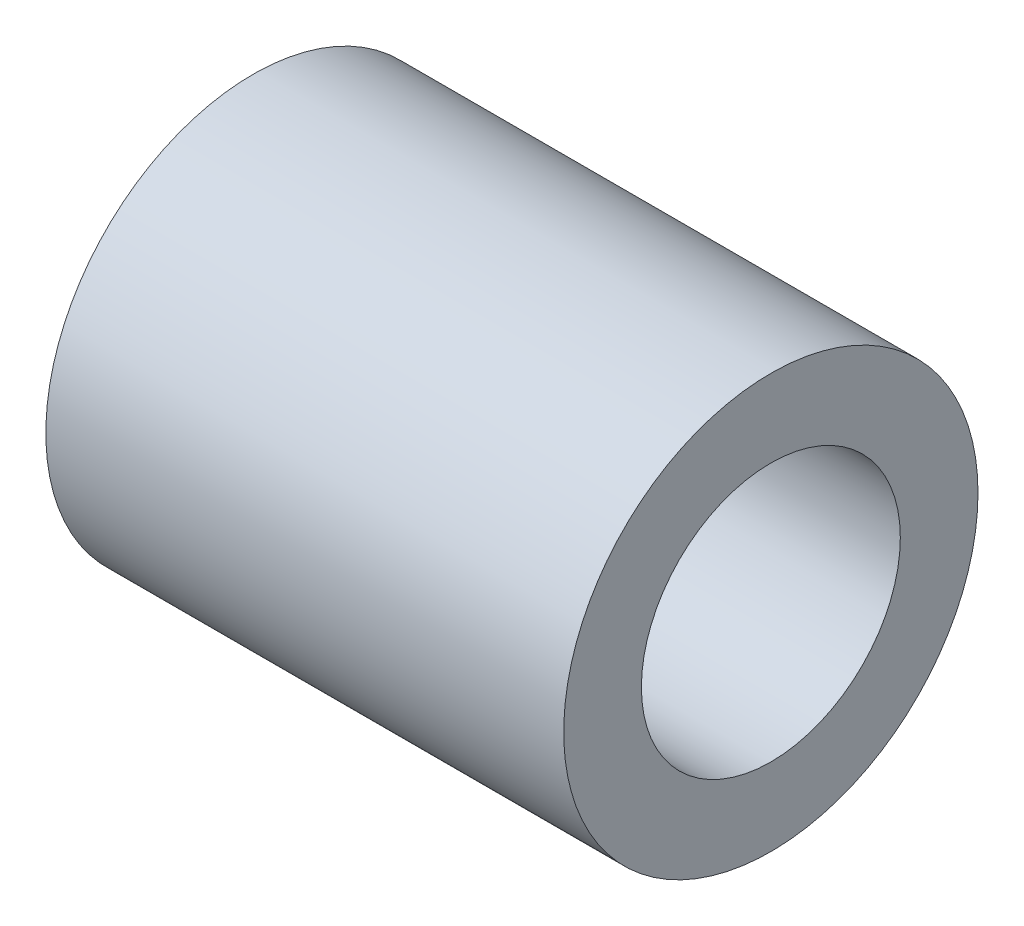
ISO-10303-21;
HEADER;
FILE_DESCRIPTION(('STEP AP214'),'2;1');
FILE_NAME('part.step','',(''),(''),'','','');
FILE_SCHEMA(('AUTOMOTIVE_DESIGN { 1 0 10303 214 1 1 1 1 }'));
ENDSEC;
DATA;
#1=APPLICATION_CONTEXT('core data for automotive mechanical design processes');
#2=APPLICATION_PROTOCOL_DEFINITION('international standard','automotive_design',2000,#1);
#3=PRODUCT_CONTEXT('',#1,'mechanical');
#4=PRODUCT('Part','Part','',(#3));
#5=PRODUCT_RELATED_PRODUCT_CATEGORY('part','',(#4));
#6=PRODUCT_DEFINITION_FORMATION('','',#4);
#7=PRODUCT_DEFINITION_CONTEXT('part definition',#1,'design');
#8=PRODUCT_DEFINITION('design','',#6,#7);
#9=PRODUCT_DEFINITION_SHAPE('','',#8);
#10=(LENGTH_UNIT() NAMED_UNIT(*) SI_UNIT(.MILLI.,.METRE.));
#11=(NAMED_UNIT(*) PLANE_ANGLE_UNIT() SI_UNIT($,.RADIAN.));
#12=(NAMED_UNIT(*) SI_UNIT($,.STERADIAN.) SOLID_ANGLE_UNIT());
#13=UNCERTAINTY_MEASURE_WITH_UNIT(LENGTH_MEASURE(1.E-05),#10,'distance_accuracy_value','');
#14=(GEOMETRIC_REPRESENTATION_CONTEXT(3) GLOBAL_UNCERTAINTY_ASSIGNED_CONTEXT((#13)) GLOBAL_UNIT_ASSIGNED_CONTEXT((#10,
#11,#12)) REPRESENTATION_CONTEXT('',''));
#15=CARTESIAN_POINT('',(0.,0.,0.));
#16=DIRECTION('',(0.,0.,1.));
#17=DIRECTION('',(1.,0.,0.));
#18=AXIS2_PLACEMENT_3D('',#15,#16,#17);
#19=CARTESIAN_POINT('',(10.,0.,0.));
#20=DIRECTION('',(1.,0.,0.));
#21=DIRECTION('',(0.,0.,-1.));
#22=AXIS2_PLACEMENT_3D('',#19,#20,#21);
#23=PLANE('',#22);
#24=CARTESIAN_POINT('',(10.,0.,0.));
#25=DIRECTION('',(1.,0.,0.));
#26=DIRECTION('',(0.,0.,-1.));
#27=AXIS2_PLACEMENT_3D('',#24,#25,#26);
#28=CIRCLE('',#27,4.);
#29=CARTESIAN_POINT('',(10.,0.,-4.));
#30=VERTEX_POINT('',#29);
#31=EDGE_CURVE('E10',#30,#30,#28,.T.);
#32=ORIENTED_EDGE('',*,*,#31,.T.);
#33=EDGE_LOOP('',(#32));
#34=FACE_BOUND('',#33,.T.);
#35=CARTESIAN_POINT('',(10.,0.,0.));
#36=DIRECTION('',(1.,0.,0.));
#37=DIRECTION('',(0.,0.,-1.));
#38=AXIS2_PLACEMENT_3D('',#35,#36,#37);
#39=CIRCLE('',#38,2.5);
#40=CARTESIAN_POINT('',(10.,0.,-2.5));
#41=VERTEX_POINT('',#40);
#42=EDGE_CURVE('E40',#41,#41,#39,.T.);
#43=ORIENTED_EDGE('',*,*,#42,.F.);
#44=EDGE_LOOP('',(#43));
#45=FACE_BOUND('',#44,.T.);
#46=ADVANCED_FACE('F29',(#34,#45),#23,.T.);
#47=CARTESIAN_POINT('',(0.,0.,0.));
#48=DIRECTION('',(1.,0.,0.));
#49=DIRECTION('',(0.,0.,-1.));
#50=AXIS2_PLACEMENT_3D('',#47,#48,#49);
#51=PLANE('',#50);
#52=CARTESIAN_POINT('',(0.,0.,0.));
#53=DIRECTION('',(1.,0.,0.));
#54=DIRECTION('',(0.,0.,-1.));
#55=AXIS2_PLACEMENT_3D('',#52,#53,#54);
#56=CIRCLE('',#55,4.);
#57=CARTESIAN_POINT('',(0.,0.,-4.));
#58=VERTEX_POINT('',#57);
#59=EDGE_CURVE('E33',#58,#58,#56,.T.);
#60=ORIENTED_EDGE('',*,*,#59,.F.);
#61=EDGE_LOOP('',(#60));
#62=FACE_BOUND('',#61,.T.);
#63=CARTESIAN_POINT('',(0.,0.,0.));
#64=DIRECTION('',(1.,0.,0.));
#65=DIRECTION('',(0.,0.,-1.));
#66=AXIS2_PLACEMENT_3D('',#63,#64,#65);
#67=CIRCLE('',#66,2.5);
#68=CARTESIAN_POINT('',(0.,0.,-2.5));
#69=VERTEX_POINT('',#68);
#70=EDGE_CURVE('E42',#69,#69,#67,.T.);
#71=ORIENTED_EDGE('',*,*,#70,.T.);
#72=EDGE_LOOP('',(#71));
#73=FACE_BOUND('',#72,.T.);
#74=ADVANCED_FACE('F52',(#62,#73),#51,.F.);
#75=CARTESIAN_POINT('',(10.,0.,0.));
#76=DIRECTION('',(-1.,0.,0.));
#77=DIRECTION('',(0.,0.,1.));
#78=AXIS2_PLACEMENT_3D('',#75,#76,#77);
#79=CYLINDRICAL_SURFACE('',#78,4.);
#80=ORIENTED_EDGE('',*,*,#31,.F.);
#81=EDGE_LOOP('',(#80));
#82=FACE_BOUND('',#81,.T.);
#83=ORIENTED_EDGE('',*,*,#59,.T.);
#84=EDGE_LOOP('',(#83));
#85=FACE_BOUND('',#84,.T.);
#86=ADVANCED_FACE('F31',(#82,#85),#79,.T.);
#87=CARTESIAN_POINT('',(10.,0.,0.));
#88=DIRECTION('',(-1.,0.,0.));
#89=DIRECTION('',(0.,0.,1.));
#90=AXIS2_PLACEMENT_3D('',#87,#88,#89);
#91=CYLINDRICAL_SURFACE('',#90,2.5);
#92=ORIENTED_EDGE('',*,*,#42,.T.);
#93=EDGE_LOOP('',(#92));
#94=FACE_BOUND('',#93,.T.);
#95=ORIENTED_EDGE('',*,*,#70,.F.);
#96=EDGE_LOOP('',(#95));
#97=FACE_BOUND('',#96,.T.);
#98=ADVANCED_FACE('F48',(#94,#97),#91,.F.);
#99=CLOSED_SHELL('',(#46,#74,#86,#98));
#100=MANIFOLD_SOLID_BREP('B2',#99);
#101=ADVANCED_BREP_SHAPE_REPRESENTATION('',(#18,#100),#14);
#102=SHAPE_DEFINITION_REPRESENTATION(#9,#101);
ENDSEC;
END-ISO-10303-21;
